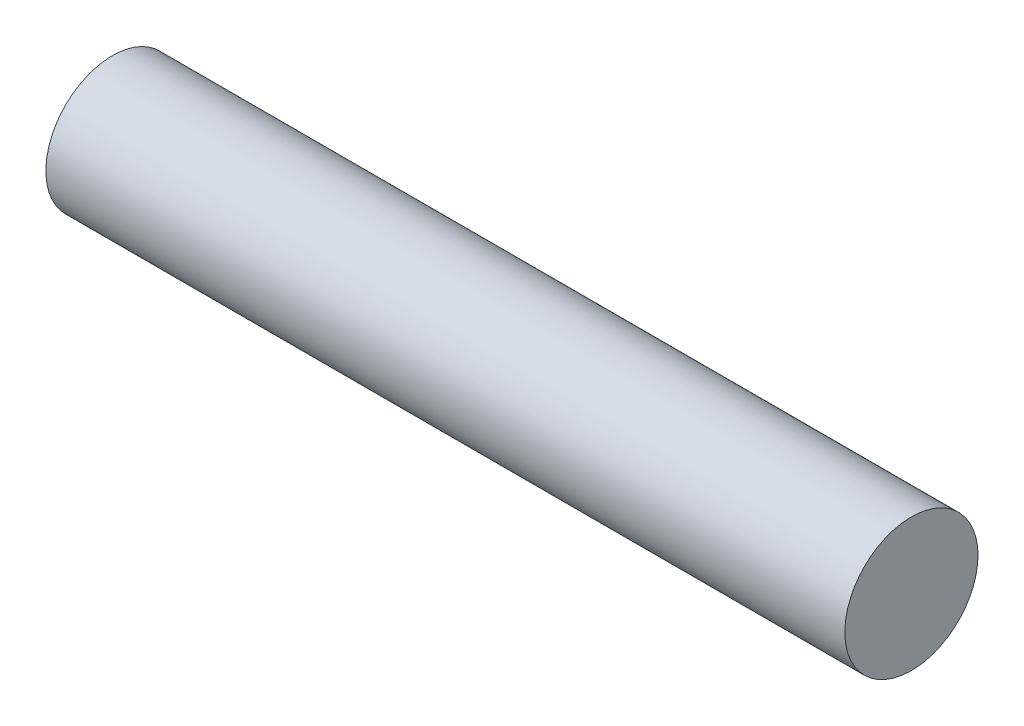
ISO-10303-21;
HEADER;
FILE_DESCRIPTION(('STEP AP214'),'2;1');
FILE_NAME('part.step','',(''),(''),'','','');
FILE_SCHEMA(('AUTOMOTIVE_DESIGN { 1 0 10303 214 1 1 1 1 }'));
ENDSEC;
DATA;
#1=APPLICATION_CONTEXT('core data for automotive mechanical design processes');
#2=APPLICATION_PROTOCOL_DEFINITION('international standard','automotive_design',2000,#1);
#3=PRODUCT_CONTEXT('',#1,'mechanical');
#4=PRODUCT('Part','Part','',(#3));
#5=PRODUCT_RELATED_PRODUCT_CATEGORY('part','',(#4));
#6=PRODUCT_DEFINITION_FORMATION('','',#4);
#7=PRODUCT_DEFINITION_CONTEXT('part definition',#1,'design');
#8=PRODUCT_DEFINITION('design','',#6,#7);
#9=PRODUCT_DEFINITION_SHAPE('','',#8);
#10=(LENGTH_UNIT() NAMED_UNIT(*) SI_UNIT(.MILLI.,.METRE.));
#11=(NAMED_UNIT(*) PLANE_ANGLE_UNIT() SI_UNIT($,.RADIAN.));
#12=(NAMED_UNIT(*) SI_UNIT($,.STERADIAN.) SOLID_ANGLE_UNIT());
#13=UNCERTAINTY_MEASURE_WITH_UNIT(LENGTH_MEASURE(1.E-05),#10,'distance_accuracy_value','');
#14=(GEOMETRIC_REPRESENTATION_CONTEXT(3) GLOBAL_UNCERTAINTY_ASSIGNED_CONTEXT((#13)) GLOBAL_UNIT_ASSIGNED_CONTEXT((#10,
#11,#12)) REPRESENTATION_CONTEXT('',''));
#15=CARTESIAN_POINT('',(0.,0.,0.));
#16=DIRECTION('',(0.,0.,1.));
#17=DIRECTION('',(1.,0.,0.));
#18=AXIS2_PLACEMENT_3D('',#15,#16,#17);
#19=CARTESIAN_POINT('',(76.2,0.,0.));
#20=DIRECTION('',(-1.,0.,0.));
#21=DIRECTION('',(0.,0.,1.));
#22=AXIS2_PLACEMENT_3D('',#19,#20,#21);
#23=CYLINDRICAL_SURFACE('',#22,6.35);
#24=CARTESIAN_POINT('',(76.2,0.,0.));
#25=DIRECTION('',(1.,0.,0.));
#26=DIRECTION('',(0.,0.,-1.));
#27=AXIS2_PLACEMENT_3D('',#24,#25,#26);
#28=CIRCLE('',#27,6.35);
#29=CARTESIAN_POINT('',(76.2,0.,-6.35));
#30=VERTEX_POINT('',#29);
#31=EDGE_CURVE('E10',#30,#30,#28,.T.);
#32=ORIENTED_EDGE('',*,*,#31,.F.);
#33=EDGE_LOOP('',(#32));
#34=FACE_BOUND('',#33,.T.);
#35=CARTESIAN_POINT('',(0.,0.,0.));
#36=DIRECTION('',(1.,0.,0.));
#37=DIRECTION('',(0.,0.,-1.));
#38=AXIS2_PLACEMENT_3D('',#35,#36,#37);
#39=CIRCLE('',#38,6.35);
#40=CARTESIAN_POINT('',(0.,0.,-6.35));
#41=VERTEX_POINT('',#40);
#42=EDGE_CURVE('E34',#41,#41,#39,.T.);
#43=ORIENTED_EDGE('',*,*,#42,.T.);
#44=EDGE_LOOP('',(#43));
#45=FACE_BOUND('',#44,.T.);
#46=ADVANCED_FACE('F31',(#34,#45),#23,.T.);
#47=CARTESIAN_POINT('',(76.2,0.,0.));
#48=DIRECTION('',(1.,0.,0.));
#49=DIRECTION('',(0.,0.,-1.));
#50=AXIS2_PLACEMENT_3D('',#47,#48,#49);
#51=PLANE('',#50);
#52=ORIENTED_EDGE('',*,*,#31,.T.);
#53=EDGE_LOOP('',(#52));
#54=FACE_BOUND('',#53,.T.);
#55=ADVANCED_FACE('F46',(#54),#51,.T.);
#56=CARTESIAN_POINT('',(0.,0.,0.));
#57=DIRECTION('',(1.,0.,0.));
#58=DIRECTION('',(0.,0.,-1.));
#59=AXIS2_PLACEMENT_3D('',#56,#57,#58);
#60=PLANE('',#59);
#61=ORIENTED_EDGE('',*,*,#42,.F.);
#62=EDGE_LOOP('',(#61));
#63=FACE_BOUND('',#62,.T.);
#64=ADVANCED_FACE('F44',(#63),#60,.F.);
#65=CLOSED_SHELL('',(#46,#55,#64));
#66=MANIFOLD_SOLID_BREP('B2',#65);
#67=ADVANCED_BREP_SHAPE_REPRESENTATION('',(#18,#66),#14);
#68=SHAPE_DEFINITION_REPRESENTATION(#9,#67);
ENDSEC;
END-ISO-10303-21;
